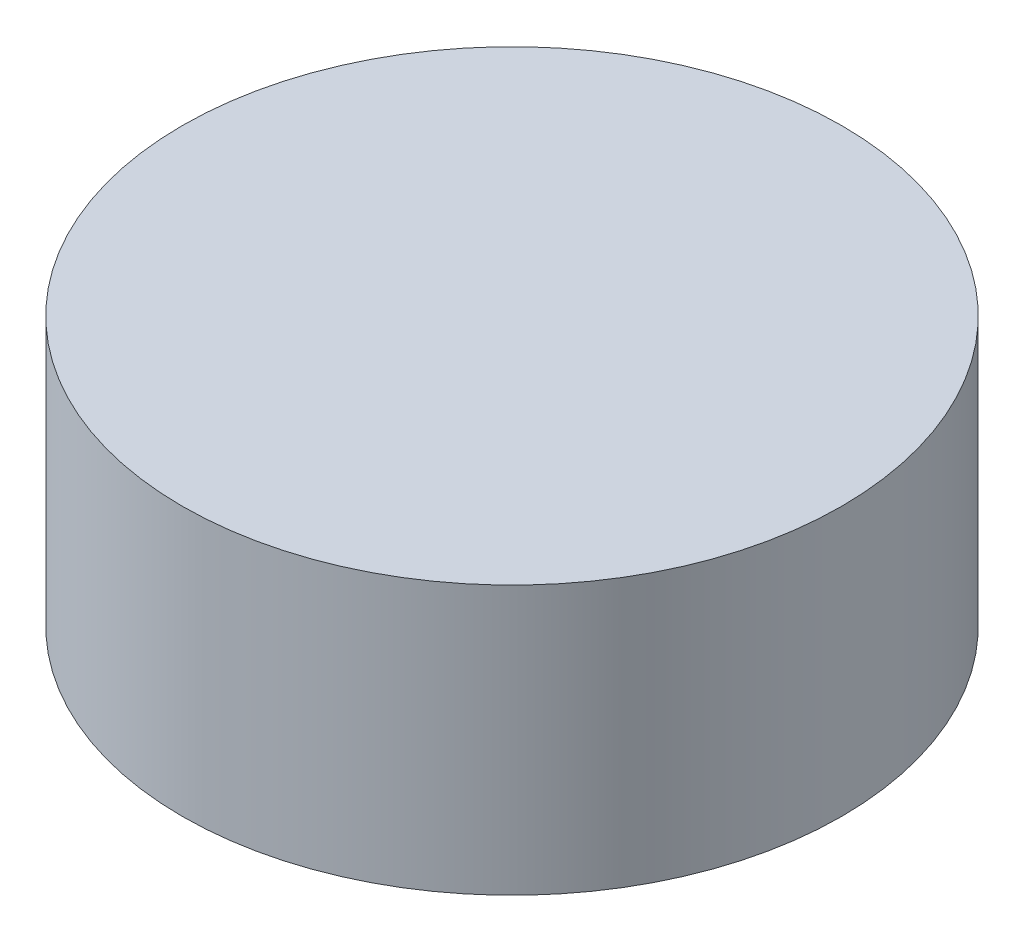
ISO-10303-21;
HEADER;
FILE_DESCRIPTION(('STEP AP214'),'2;1');
FILE_NAME('part.step','',(''),(''),'','','');
FILE_SCHEMA(('AUTOMOTIVE_DESIGN { 1 0 10303 214 1 1 1 1 }'));
ENDSEC;
DATA;
#1=APPLICATION_CONTEXT('core data for automotive mechanical design processes');
#2=APPLICATION_PROTOCOL_DEFINITION('international standard','automotive_design',2000,#1);
#3=PRODUCT_CONTEXT('',#1,'mechanical');
#4=PRODUCT('Part','Part','',(#3));
#5=PRODUCT_RELATED_PRODUCT_CATEGORY('part','',(#4));
#6=PRODUCT_DEFINITION_FORMATION('','',#4);
#7=PRODUCT_DEFINITION_CONTEXT('part definition',#1,'design');
#8=PRODUCT_DEFINITION('design','',#6,#7);
#9=PRODUCT_DEFINITION_SHAPE('','',#8);
#10=(LENGTH_UNIT() NAMED_UNIT(*) SI_UNIT(.MILLI.,.METRE.));
#11=(NAMED_UNIT(*) PLANE_ANGLE_UNIT() SI_UNIT($,.RADIAN.));
#12=(NAMED_UNIT(*) SI_UNIT($,.STERADIAN.) SOLID_ANGLE_UNIT());
#13=UNCERTAINTY_MEASURE_WITH_UNIT(LENGTH_MEASURE(1.E-05),#10,'distance_accuracy_value','');
#14=(GEOMETRIC_REPRESENTATION_CONTEXT(3) GLOBAL_UNCERTAINTY_ASSIGNED_CONTEXT((#13)) GLOBAL_UNIT_ASSIGNED_CONTEXT((#10,
#11,#12)) REPRESENTATION_CONTEXT('',''));
#15=CARTESIAN_POINT('',(0.,0.,0.));
#16=DIRECTION('',(0.,0.,1.));
#17=DIRECTION('',(1.,0.,0.));
#18=AXIS2_PLACEMENT_3D('',#15,#16,#17);
#19=CARTESIAN_POINT('',(322.004322273203,-152.3,84.6899338377505));
#20=DIRECTION('',(0.,-1.,0.));
#21=DIRECTION('',(0.,0.,-1.));
#22=AXIS2_PLACEMENT_3D('',#19,#20,#21);
#23=PLANE('',#22);
#24=CARTESIAN_POINT('',(358.825322273203,-152.3,47.8689338377505));
#25=DIRECTION('',(0.,-1.,0.));
#26=DIRECTION('',(0.,0.,-1.));
#27=AXIS2_PLACEMENT_3D('',#24,#25,#26);
#28=CIRCLE('',#27,36.82);
#29=CARTESIAN_POINT('',(358.825322273203,-152.3,11.0489338377505));
#30=VERTEX_POINT('',#29);
#31=EDGE_CURVE('E18',#30,#30,#28,.F.);
#32=ORIENTED_EDGE('',*,*,#31,.F.);
#33=EDGE_LOOP('',(#32));
#34=FACE_BOUND('',#33,.T.);
#35=ADVANCED_FACE('F14',(#34),#23,.T.);
#36=CARTESIAN_POINT('',(322.004322273203,-122.3,11.0479338377505));
#37=DIRECTION('',(0.,1.,0.));
#38=DIRECTION('',(0.,0.,1.));
#39=AXIS2_PLACEMENT_3D('',#36,#37,#38);
#40=PLANE('',#39);
#41=CARTESIAN_POINT('',(358.825322273203,-122.3,47.8689338377505));
#42=DIRECTION('',(0.,-1.,0.));
#43=DIRECTION('',(0.,0.,-1.));
#44=AXIS2_PLACEMENT_3D('',#41,#42,#43);
#45=CIRCLE('',#44,36.82);
#46=CARTESIAN_POINT('',(358.825322273203,-122.3,11.0489338377505));
#47=VERTEX_POINT('',#46);
#48=EDGE_CURVE('E10',#47,#47,#45,.T.);
#49=ORIENTED_EDGE('',*,*,#48,.F.);
#50=EDGE_LOOP('',(#49));
#51=FACE_BOUND('',#50,.T.);
#52=ADVANCED_FACE('F32',(#51),#40,.T.);
#53=CARTESIAN_POINT('',(358.825322273203,-122.3,47.8689338377505));
#54=DIRECTION('',(0.,-1.,0.));
#55=DIRECTION('',(0.,0.,-1.));
#56=AXIS2_PLACEMENT_3D('',#53,#54,#55);
#57=CYLINDRICAL_SURFACE('',#56,36.82);
#58=ORIENTED_EDGE('',*,*,#48,.T.);
#59=EDGE_LOOP('',(#58));
#60=FACE_BOUND('',#59,.T.);
#61=ORIENTED_EDGE('',*,*,#31,.T.);
#62=EDGE_LOOP('',(#61));
#63=FACE_BOUND('',#62,.T.);
#64=ADVANCED_FACE('F16',(#60,#63),#57,.T.);
#65=CLOSED_SHELL('',(#35,#52,#64));
#66=MANIFOLD_SOLID_BREP('B1',#65);
#67=ADVANCED_BREP_SHAPE_REPRESENTATION('',(#18,#66),#14);
#68=SHAPE_DEFINITION_REPRESENTATION(#9,#67);
ENDSEC;
END-ISO-10303-21;
